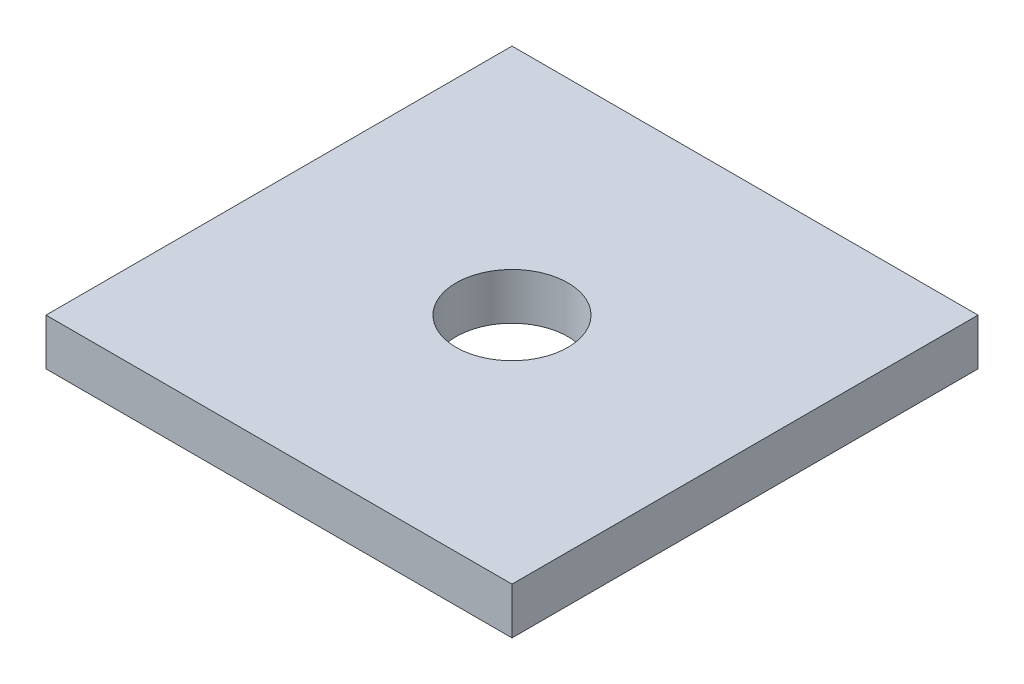
ISO-10303-21;
HEADER;
FILE_DESCRIPTION(('STEP AP214'),'2;1');
FILE_NAME('part.step','',(''),(''),'','','');
FILE_SCHEMA(('AUTOMOTIVE_DESIGN { 1 0 10303 214 1 1 1 1 }'));
ENDSEC;
DATA;
#1=APPLICATION_CONTEXT('core data for automotive mechanical design processes');
#2=APPLICATION_PROTOCOL_DEFINITION('international standard','automotive_design',2000,#1);
#3=PRODUCT_CONTEXT('',#1,'mechanical');
#4=PRODUCT('Part','Part','',(#3));
#5=PRODUCT_RELATED_PRODUCT_CATEGORY('part','',(#4));
#6=PRODUCT_DEFINITION_FORMATION('','',#4);
#7=PRODUCT_DEFINITION_CONTEXT('part definition',#1,'design');
#8=PRODUCT_DEFINITION('design','',#6,#7);
#9=PRODUCT_DEFINITION_SHAPE('','',#8);
#10=(LENGTH_UNIT() NAMED_UNIT(*) SI_UNIT(.MILLI.,.METRE.));
#11=(NAMED_UNIT(*) PLANE_ANGLE_UNIT() SI_UNIT($,.RADIAN.));
#12=(NAMED_UNIT(*) SI_UNIT($,.STERADIAN.) SOLID_ANGLE_UNIT());
#13=UNCERTAINTY_MEASURE_WITH_UNIT(LENGTH_MEASURE(1.E-05),#10,'distance_accuracy_value','');
#14=(GEOMETRIC_REPRESENTATION_CONTEXT(3) GLOBAL_UNCERTAINTY_ASSIGNED_CONTEXT((#13)) GLOBAL_UNIT_ASSIGNED_CONTEXT((#10,
#11,#12)) REPRESENTATION_CONTEXT('',''));
#15=CARTESIAN_POINT('',(0.,0.,0.));
#16=DIRECTION('',(0.,0.,1.));
#17=DIRECTION('',(1.,0.,0.));
#18=AXIS2_PLACEMENT_3D('',#15,#16,#17);
#19=CARTESIAN_POINT('',(0.,5.,0.));
#20=DIRECTION('',(0.,-1.,0.));
#21=DIRECTION('',(0.,0.,-1.));
#22=AXIS2_PLACEMENT_3D('',#19,#20,#21);
#23=PLANE('',#22);
#24=DIRECTION('',(0.,0.,1.));
#25=VECTOR('',#24,1.);
#26=CARTESIAN_POINT('',(0.,5.,0.));
#27=LINE('',#26,#25);
#28=CARTESIAN_POINT('',(0.,5.,-50.));
#29=VERTEX_POINT('',#28);
#30=CARTESIAN_POINT('',(0.,5.,0.));
#31=VERTEX_POINT('',#30);
#32=EDGE_CURVE('E87',#29,#31,#27,.T.);
#33=ORIENTED_EDGE('',*,*,#32,.T.);
#34=DIRECTION('',(1.,0.,0.));
#35=VECTOR('',#34,1.);
#36=CARTESIAN_POINT('',(0.,5.,0.));
#37=LINE('',#36,#35);
#38=CARTESIAN_POINT('',(50.,5.,0.));
#39=VERTEX_POINT('',#38);
#40=EDGE_CURVE('E82',#31,#39,#37,.T.);
#41=ORIENTED_EDGE('',*,*,#40,.T.);
#42=DIRECTION('',(0.,0.,-1.));
#43=VECTOR('',#42,1.);
#44=CARTESIAN_POINT('',(50.,5.,0.));
#45=LINE('',#44,#43);
#46=CARTESIAN_POINT('',(50.,5.,-50.));
#47=VERTEX_POINT('',#46);
#48=EDGE_CURVE('E85',#39,#47,#45,.T.);
#49=ORIENTED_EDGE('',*,*,#48,.T.);
#50=DIRECTION('',(-1.,0.,0.));
#51=VECTOR('',#50,1.);
#52=CARTESIAN_POINT('',(0.,5.,-50.));
#53=LINE('',#52,#51);
#54=EDGE_CURVE('E52',#47,#29,#53,.T.);
#55=ORIENTED_EDGE('',*,*,#54,.T.);
#56=EDGE_LOOP('',(#33,#41,#49,#55));
#57=FACE_BOUND('',#56,.T.);
#58=CARTESIAN_POINT('',(25.,5.,-25.));
#59=DIRECTION('',(0.,1.,0.));
#60=DIRECTION('',(0.,0.,1.));
#61=AXIS2_PLACEMENT_3D('',#58,#59,#60);
#62=CIRCLE('',#61,6.);
#63=CARTESIAN_POINT('',(25.,5.,-19.));
#64=VERTEX_POINT('',#63);
#65=EDGE_CURVE('E102',#64,#64,#62,.T.);
#66=ORIENTED_EDGE('',*,*,#65,.F.);
#67=EDGE_LOOP('',(#66));
#68=FACE_BOUND('',#67,.T.);
#69=ADVANCED_FACE('F35',(#57,#68),#23,.F.);
#70=CARTESIAN_POINT('',(0.,0.,0.));
#71=DIRECTION('',(0.,-1.,0.));
#72=DIRECTION('',(0.,0.,-1.));
#73=AXIS2_PLACEMENT_3D('',#70,#71,#72);
#74=PLANE('',#73);
#75=DIRECTION('',(0.,0.,1.));
#76=VECTOR('',#75,1.);
#77=CARTESIAN_POINT('',(0.,0.,0.));
#78=LINE('',#77,#76);
#79=CARTESIAN_POINT('',(0.,0.,-50.));
#80=VERTEX_POINT('',#79);
#81=CARTESIAN_POINT('',(0.,0.,0.));
#82=VERTEX_POINT('',#81);
#83=EDGE_CURVE('E99',#80,#82,#78,.T.);
#84=ORIENTED_EDGE('',*,*,#83,.F.);
#85=DIRECTION('',(-1.,0.,0.));
#86=VECTOR('',#85,1.);
#87=CARTESIAN_POINT('',(0.,0.,-50.));
#88=LINE('',#87,#86);
#89=CARTESIAN_POINT('',(50.,0.,-50.));
#90=VERTEX_POINT('',#89);
#91=EDGE_CURVE('E75',#90,#80,#88,.T.);
#92=ORIENTED_EDGE('',*,*,#91,.F.);
#93=DIRECTION('',(0.,0.,-1.));
#94=VECTOR('',#93,1.);
#95=CARTESIAN_POINT('',(50.,0.,0.));
#96=LINE('',#95,#94);
#97=CARTESIAN_POINT('',(50.,0.,0.));
#98=VERTEX_POINT('',#97);
#99=EDGE_CURVE('E69',#98,#90,#96,.T.);
#100=ORIENTED_EDGE('',*,*,#99,.F.);
#101=DIRECTION('',(1.,0.,0.));
#102=VECTOR('',#101,1.);
#103=CARTESIAN_POINT('',(0.,0.,0.));
#104=LINE('',#103,#102);
#105=EDGE_CURVE('E91',#82,#98,#104,.T.);
#106=ORIENTED_EDGE('',*,*,#105,.F.);
#107=EDGE_LOOP('',(#84,#92,#100,#106));
#108=FACE_BOUND('',#107,.T.);
#109=CARTESIAN_POINT('',(25.,0.,-25.));
#110=DIRECTION('',(0.,1.,0.));
#111=DIRECTION('',(0.,0.,1.));
#112=AXIS2_PLACEMENT_3D('',#109,#110,#111);
#113=CIRCLE('',#112,6.);
#114=CARTESIAN_POINT('',(25.,0.,-19.));
#115=VERTEX_POINT('',#114);
#116=EDGE_CURVE('E114',#115,#115,#113,.T.);
#117=ORIENTED_EDGE('',*,*,#116,.T.);
#118=EDGE_LOOP('',(#117));
#119=FACE_BOUND('',#118,.T.);
#120=ADVANCED_FACE('F110',(#108,#119),#74,.T.);
#121=CARTESIAN_POINT('',(0.,5.,0.));
#122=DIRECTION('',(1.,0.,0.));
#123=DIRECTION('',(0.,0.,-1.));
#124=AXIS2_PLACEMENT_3D('',#121,#122,#123);
#125=PLANE('',#124);
#126=ORIENTED_EDGE('',*,*,#83,.T.);
#127=DIRECTION('',(0.,-1.,0.));
#128=VECTOR('',#127,1.);
#129=CARTESIAN_POINT('',(0.,5.,0.));
#130=LINE('',#129,#128);
#131=EDGE_CURVE('E11',#31,#82,#130,.T.);
#132=ORIENTED_EDGE('',*,*,#131,.F.);
#133=ORIENTED_EDGE('',*,*,#32,.F.);
#134=DIRECTION('',(0.,-1.,0.));
#135=VECTOR('',#134,1.);
#136=CARTESIAN_POINT('',(0.,5.,-50.));
#137=LINE('',#136,#135);
#138=EDGE_CURVE('E95',#29,#80,#137,.T.);
#139=ORIENTED_EDGE('',*,*,#138,.T.);
#140=EDGE_LOOP('',(#126,#132,#133,#139));
#141=FACE_BOUND('',#140,.T.);
#142=ADVANCED_FACE('F37',(#141),#125,.F.);
#143=CARTESIAN_POINT('',(0.,5.,0.));
#144=DIRECTION('',(0.,0.,-1.));
#145=DIRECTION('',(-1.,0.,0.));
#146=AXIS2_PLACEMENT_3D('',#143,#144,#145);
#147=PLANE('',#146);
#148=ORIENTED_EDGE('',*,*,#105,.T.);
#149=DIRECTION('',(0.,-1.,0.));
#150=VECTOR('',#149,1.);
#151=CARTESIAN_POINT('',(50.,5.,0.));
#152=LINE('',#151,#150);
#153=EDGE_CURVE('E44',#39,#98,#152,.T.);
#154=ORIENTED_EDGE('',*,*,#153,.F.);
#155=ORIENTED_EDGE('',*,*,#40,.F.);
#156=ORIENTED_EDGE('',*,*,#131,.T.);
#157=EDGE_LOOP('',(#148,#154,#155,#156));
#158=FACE_BOUND('',#157,.T.);
#159=ADVANCED_FACE('F90',(#158),#147,.F.);
#160=CARTESIAN_POINT('',(50.,5.,0.));
#161=DIRECTION('',(-1.,0.,0.));
#162=DIRECTION('',(0.,0.,1.));
#163=AXIS2_PLACEMENT_3D('',#160,#161,#162);
#164=PLANE('',#163);
#165=ORIENTED_EDGE('',*,*,#99,.T.);
#166=DIRECTION('',(0.,-1.,0.));
#167=VECTOR('',#166,1.);
#168=CARTESIAN_POINT('',(50.,5.,-50.));
#169=LINE('',#168,#167);
#170=EDGE_CURVE('E92',#47,#90,#169,.T.);
#171=ORIENTED_EDGE('',*,*,#170,.F.);
#172=ORIENTED_EDGE('',*,*,#48,.F.);
#173=ORIENTED_EDGE('',*,*,#153,.T.);
#174=EDGE_LOOP('',(#165,#171,#172,#173));
#175=FACE_BOUND('',#174,.T.);
#176=ADVANCED_FACE('F93',(#175),#164,.F.);
#177=CARTESIAN_POINT('',(0.,5.,-50.));
#178=DIRECTION('',(0.,0.,1.));
#179=DIRECTION('',(1.,0.,0.));
#180=AXIS2_PLACEMENT_3D('',#177,#178,#179);
#181=PLANE('',#180);
#182=ORIENTED_EDGE('',*,*,#91,.T.);
#183=ORIENTED_EDGE('',*,*,#138,.F.);
#184=ORIENTED_EDGE('',*,*,#54,.F.);
#185=ORIENTED_EDGE('',*,*,#170,.T.);
#186=EDGE_LOOP('',(#182,#183,#184,#185));
#187=FACE_BOUND('',#186,.T.);
#188=ADVANCED_FACE('F107',(#187),#181,.F.);
#189=CARTESIAN_POINT('',(25.,5.,-25.));
#190=DIRECTION('',(0.,-1.,0.));
#191=DIRECTION('',(0.,0.,-1.));
#192=AXIS2_PLACEMENT_3D('',#189,#190,#191);
#193=CYLINDRICAL_SURFACE('',#192,6.);
#194=ORIENTED_EDGE('',*,*,#65,.T.);
#195=EDGE_LOOP('',(#194));
#196=FACE_BOUND('',#195,.T.);
#197=ORIENTED_EDGE('',*,*,#116,.F.);
#198=EDGE_LOOP('',(#197));
#199=FACE_BOUND('',#198,.T.);
#200=ADVANCED_FACE('F120',(#196,#199),#193,.F.);
#201=CLOSED_SHELL('',(#69,#120,#142,#159,#176,#188,#200));
#202=MANIFOLD_SOLID_BREP('B2',#201);
#203=ADVANCED_BREP_SHAPE_REPRESENTATION('',(#18,#202),#14);
#204=SHAPE_DEFINITION_REPRESENTATION(#9,#203);
ENDSEC;
END-ISO-10303-21;
